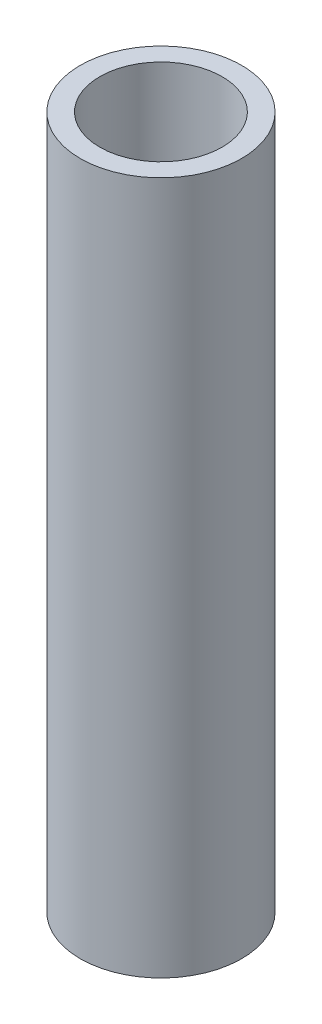
ISO-10303-21;
HEADER;
FILE_DESCRIPTION(('STEP AP214'),'2;1');
FILE_NAME('part.step','',(''),(''),'','','');
FILE_SCHEMA(('AUTOMOTIVE_DESIGN { 1 0 10303 214 1 1 1 1 }'));
ENDSEC;
DATA;
#1=APPLICATION_CONTEXT('core data for automotive mechanical design processes');
#2=APPLICATION_PROTOCOL_DEFINITION('international standard','automotive_design',2000,#1);
#3=PRODUCT_CONTEXT('',#1,'mechanical');
#4=PRODUCT('Part','Part','',(#3));
#5=PRODUCT_RELATED_PRODUCT_CATEGORY('part','',(#4));
#6=PRODUCT_DEFINITION_FORMATION('','',#4);
#7=PRODUCT_DEFINITION_CONTEXT('part definition',#1,'design');
#8=PRODUCT_DEFINITION('design','',#6,#7);
#9=PRODUCT_DEFINITION_SHAPE('','',#8);
#10=(LENGTH_UNIT() NAMED_UNIT(*) SI_UNIT(.MILLI.,.METRE.));
#11=(NAMED_UNIT(*) PLANE_ANGLE_UNIT() SI_UNIT($,.RADIAN.));
#12=(NAMED_UNIT(*) SI_UNIT($,.STERADIAN.) SOLID_ANGLE_UNIT());
#13=UNCERTAINTY_MEASURE_WITH_UNIT(LENGTH_MEASURE(1.E-05),#10,'distance_accuracy_value','');
#14=(GEOMETRIC_REPRESENTATION_CONTEXT(3) GLOBAL_UNCERTAINTY_ASSIGNED_CONTEXT((#13)) GLOBAL_UNIT_ASSIGNED_CONTEXT((#10,
#11,#12)) REPRESENTATION_CONTEXT('',''));
#15=CARTESIAN_POINT('',(0.,0.,0.));
#16=DIRECTION('',(0.,0.,1.));
#17=DIRECTION('',(1.,0.,0.));
#18=AXIS2_PLACEMENT_3D('',#15,#16,#17);
#19=CARTESIAN_POINT('',(0.,107.95,0.));
#20=DIRECTION('',(0.,1.,0.));
#21=DIRECTION('',(0.,0.,1.));
#22=AXIS2_PLACEMENT_3D('',#19,#20,#21);
#23=PLANE('',#22);
#24=CARTESIAN_POINT('',(0.,107.95,0.));
#25=DIRECTION('',(0.,1.,0.));
#26=DIRECTION('',(0.,0.,1.));
#27=AXIS2_PLACEMENT_3D('',#24,#25,#26);
#28=CIRCLE('',#27,12.573);
#29=CARTESIAN_POINT('',(0.,107.95,12.573));
#30=VERTEX_POINT('',#29);
#31=EDGE_CURVE('E10',#30,#30,#28,.T.);
#32=ORIENTED_EDGE('',*,*,#31,.T.);
#33=EDGE_LOOP('',(#32));
#34=FACE_BOUND('',#33,.T.);
#35=CARTESIAN_POINT('',(0.,107.95,0.));
#36=DIRECTION('',(0.,1.,0.));
#37=DIRECTION('',(0.,0.,1.));
#38=AXIS2_PLACEMENT_3D('',#35,#36,#37);
#39=CIRCLE('',#38,9.525);
#40=CARTESIAN_POINT('',(0.,107.95,9.525));
#41=VERTEX_POINT('',#40);
#42=EDGE_CURVE('E45',#41,#41,#39,.T.);
#43=ORIENTED_EDGE('',*,*,#42,.F.);
#44=EDGE_LOOP('',(#43));
#45=FACE_BOUND('',#44,.T.);
#46=ADVANCED_FACE('F34',(#34,#45),#23,.T.);
#47=CARTESIAN_POINT('',(0.,0.,0.));
#48=DIRECTION('',(0.,1.,0.));
#49=DIRECTION('',(0.,0.,1.));
#50=AXIS2_PLACEMENT_3D('',#47,#48,#49);
#51=PLANE('',#50);
#52=CARTESIAN_POINT('',(0.,0.,0.));
#53=DIRECTION('',(0.,1.,0.));
#54=DIRECTION('',(0.,0.,1.));
#55=AXIS2_PLACEMENT_3D('',#52,#53,#54);
#56=CIRCLE('',#55,12.573);
#57=CARTESIAN_POINT('',(0.,0.,12.573));
#58=VERTEX_POINT('',#57);
#59=EDGE_CURVE('E38',#58,#58,#56,.T.);
#60=ORIENTED_EDGE('',*,*,#59,.F.);
#61=EDGE_LOOP('',(#60));
#62=FACE_BOUND('',#61,.T.);
#63=CARTESIAN_POINT('',(0.,0.,0.));
#64=DIRECTION('',(0.,1.,0.));
#65=DIRECTION('',(0.,0.,1.));
#66=AXIS2_PLACEMENT_3D('',#63,#64,#65);
#67=CIRCLE('',#66,9.525);
#68=CARTESIAN_POINT('',(0.,0.,9.525));
#69=VERTEX_POINT('',#68);
#70=EDGE_CURVE('E47',#69,#69,#67,.T.);
#71=ORIENTED_EDGE('',*,*,#70,.T.);
#72=EDGE_LOOP('',(#71));
#73=FACE_BOUND('',#72,.T.);
#74=ADVANCED_FACE('F57',(#62,#73),#51,.F.);
#75=CARTESIAN_POINT('',(0.,107.95,0.));
#76=DIRECTION('',(0.,-1.,0.));
#77=DIRECTION('',(0.,0.,-1.));
#78=AXIS2_PLACEMENT_3D('',#75,#76,#77);
#79=CYLINDRICAL_SURFACE('',#78,12.573);
#80=ORIENTED_EDGE('',*,*,#31,.F.);
#81=EDGE_LOOP('',(#80));
#82=FACE_BOUND('',#81,.T.);
#83=ORIENTED_EDGE('',*,*,#59,.T.);
#84=EDGE_LOOP('',(#83));
#85=FACE_BOUND('',#84,.T.);
#86=ADVANCED_FACE('F36',(#82,#85),#79,.T.);
#87=CARTESIAN_POINT('',(0.,107.95,0.));
#88=DIRECTION('',(0.,-1.,0.));
#89=DIRECTION('',(0.,0.,-1.));
#90=AXIS2_PLACEMENT_3D('',#87,#88,#89);
#91=CYLINDRICAL_SURFACE('',#90,9.525);
#92=ORIENTED_EDGE('',*,*,#42,.T.);
#93=EDGE_LOOP('',(#92));
#94=FACE_BOUND('',#93,.T.);
#95=ORIENTED_EDGE('',*,*,#70,.F.);
#96=EDGE_LOOP('',(#95));
#97=FACE_BOUND('',#96,.T.);
#98=ADVANCED_FACE('F53',(#94,#97),#91,.F.);
#99=CLOSED_SHELL('',(#46,#74,#86,#98));
#100=MANIFOLD_SOLID_BREP('B2',#99);
#101=ADVANCED_BREP_SHAPE_REPRESENTATION('',(#18,#100),#14);
#102=SHAPE_DEFINITION_REPRESENTATION(#9,#101);
ENDSEC;
END-ISO-10303-21;
